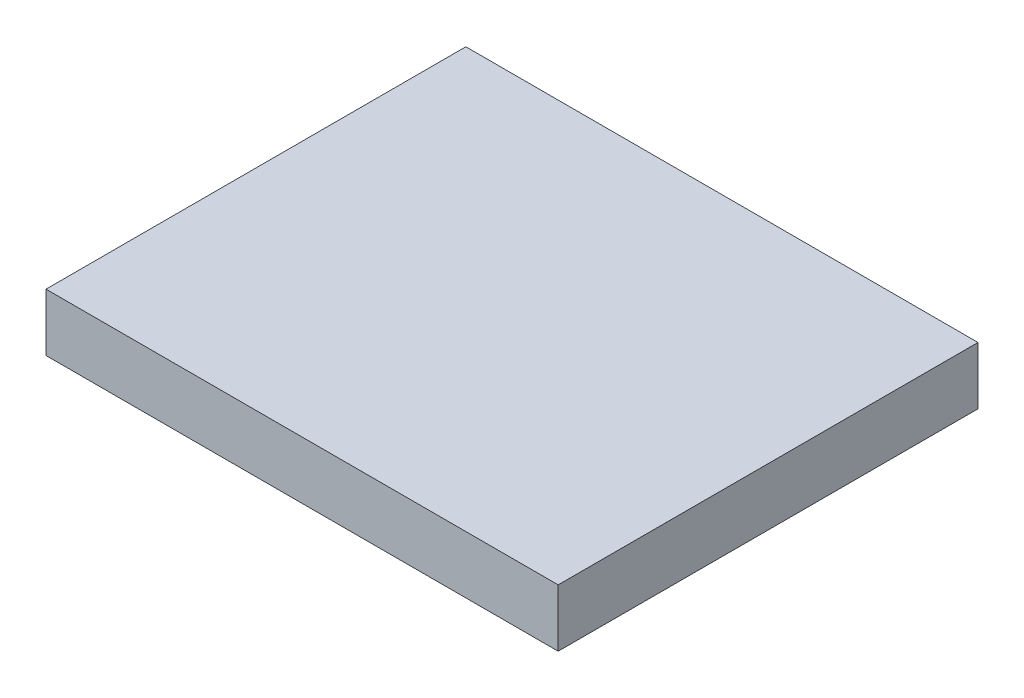
ISO-10303-21;
HEADER;
FILE_DESCRIPTION(('STEP AP214'),'2;1');
FILE_NAME('part.step','',(''),(''),'','','');
FILE_SCHEMA(('AUTOMOTIVE_DESIGN { 1 0 10303 214 1 1 1 1 }'));
ENDSEC;
DATA;
#1=APPLICATION_CONTEXT('core data for automotive mechanical design processes');
#2=APPLICATION_PROTOCOL_DEFINITION('international standard','automotive_design',2000,#1);
#3=PRODUCT_CONTEXT('',#1,'mechanical');
#4=PRODUCT('Part','Part','',(#3));
#5=PRODUCT_RELATED_PRODUCT_CATEGORY('part','',(#4));
#6=PRODUCT_DEFINITION_FORMATION('','',#4);
#7=PRODUCT_DEFINITION_CONTEXT('part definition',#1,'design');
#8=PRODUCT_DEFINITION('design','',#6,#7);
#9=PRODUCT_DEFINITION_SHAPE('','',#8);
#10=(LENGTH_UNIT() NAMED_UNIT(*) SI_UNIT(.MILLI.,.METRE.));
#11=(NAMED_UNIT(*) PLANE_ANGLE_UNIT() SI_UNIT($,.RADIAN.));
#12=(NAMED_UNIT(*) SI_UNIT($,.STERADIAN.) SOLID_ANGLE_UNIT());
#13=UNCERTAINTY_MEASURE_WITH_UNIT(LENGTH_MEASURE(1.E-05),#10,'distance_accuracy_value','');
#14=(GEOMETRIC_REPRESENTATION_CONTEXT(3) GLOBAL_UNCERTAINTY_ASSIGNED_CONTEXT((#13)) GLOBAL_UNIT_ASSIGNED_CONTEXT((#10,
#11,#12)) REPRESENTATION_CONTEXT('',''));
#15=CARTESIAN_POINT('',(0.,0.,0.));
#16=DIRECTION('',(0.,0.,1.));
#17=DIRECTION('',(1.,0.,0.));
#18=AXIS2_PLACEMENT_3D('',#15,#16,#17);
#19=CARTESIAN_POINT('',(13.9,0.,-11.6));
#20=DIRECTION('',(-1.,0.,0.));
#21=DIRECTION('',(0.,0.,1.));
#22=AXIS2_PLACEMENT_3D('',#19,#20,#21);
#23=PLANE('',#22);
#24=DIRECTION('',(0.,-1.,0.));
#25=VECTOR('',#24,1.);
#26=CARTESIAN_POINT('',(13.9,1.65,-11.6));
#27=LINE('',#26,#25);
#28=CARTESIAN_POINT('',(13.9,3.3,-11.6));
#29=VERTEX_POINT('',#28);
#30=CARTESIAN_POINT('',(13.9,0.,-11.6));
#31=VERTEX_POINT('',#30);
#32=EDGE_CURVE('E65',#29,#31,#27,.T.);
#33=ORIENTED_EDGE('',*,*,#32,.F.);
#34=DIRECTION('',(0.,0.,1.));
#35=VECTOR('',#34,1.);
#36=CARTESIAN_POINT('',(13.9,3.3,0.450000000000001));
#37=LINE('',#36,#35);
#38=CARTESIAN_POINT('',(13.9,3.3,12.5));
#39=VERTEX_POINT('',#38);
#40=EDGE_CURVE('E98',#29,#39,#37,.T.);
#41=ORIENTED_EDGE('',*,*,#40,.T.);
#42=DIRECTION('',(0.,1.,0.));
#43=VECTOR('',#42,1.);
#44=CARTESIAN_POINT('',(13.9,1.65,12.5));
#45=LINE('',#44,#43);
#46=CARTESIAN_POINT('',(13.9,0.,12.5));
#47=VERTEX_POINT('',#46);
#48=EDGE_CURVE('E20',#47,#39,#45,.T.);
#49=ORIENTED_EDGE('',*,*,#48,.F.);
#50=DIRECTION('',(0.,0.,1.));
#51=VECTOR('',#50,1.);
#52=CARTESIAN_POINT('',(13.9,0.,0.450000000000001));
#53=LINE('',#52,#51);
#54=EDGE_CURVE('E95',#31,#47,#53,.T.);
#55=ORIENTED_EDGE('',*,*,#54,.F.);
#56=EDGE_LOOP('',(#33,#41,#49,#55));
#57=FACE_BOUND('',#56,.T.);
#58=ADVANCED_FACE('F16',(#57),#23,.F.);
#59=CARTESIAN_POINT('',(-15.5,0.,12.5));
#60=DIRECTION('',(0.,0.,1.));
#61=DIRECTION('',(1.,0.,0.));
#62=AXIS2_PLACEMENT_3D('',#59,#60,#61);
#63=PLANE('',#62);
#64=ORIENTED_EDGE('',*,*,#48,.T.);
#65=DIRECTION('',(-1.,0.,0.));
#66=VECTOR('',#65,1.);
#67=CARTESIAN_POINT('',(-0.799999999999999,3.3,12.5));
#68=LINE('',#67,#66);
#69=CARTESIAN_POINT('',(-15.5,3.3,12.5));
#70=VERTEX_POINT('',#69);
#71=EDGE_CURVE('E70',#39,#70,#68,.T.);
#72=ORIENTED_EDGE('',*,*,#71,.T.);
#73=DIRECTION('',(0.,-1.,0.));
#74=VECTOR('',#73,1.);
#75=CARTESIAN_POINT('',(-15.5,1.65,12.5));
#76=LINE('',#75,#74);
#77=CARTESIAN_POINT('',(-15.5,0.,12.5));
#78=VERTEX_POINT('',#77);
#79=EDGE_CURVE('E60',#70,#78,#76,.T.);
#80=ORIENTED_EDGE('',*,*,#79,.T.);
#81=DIRECTION('',(-1.,0.,0.));
#82=VECTOR('',#81,1.);
#83=CARTESIAN_POINT('',(-0.799999999999999,0.,12.5));
#84=LINE('',#83,#82);
#85=EDGE_CURVE('E97',#47,#78,#84,.T.);
#86=ORIENTED_EDGE('',*,*,#85,.F.);
#87=EDGE_LOOP('',(#64,#72,#80,#86));
#88=FACE_BOUND('',#87,.T.);
#89=ADVANCED_FACE('F76',(#88),#63,.T.);
#90=CARTESIAN_POINT('',(-15.5,0.,12.5));
#91=DIRECTION('',(1.,0.,0.));
#92=DIRECTION('',(0.,0.,-1.));
#93=AXIS2_PLACEMENT_3D('',#90,#91,#92);
#94=PLANE('',#93);
#95=ORIENTED_EDGE('',*,*,#79,.F.);
#96=DIRECTION('',(0.,0.,-1.));
#97=VECTOR('',#96,1.);
#98=CARTESIAN_POINT('',(-15.5,3.3,0.450000000000001));
#99=LINE('',#98,#97);
#100=CARTESIAN_POINT('',(-15.5,3.3,-11.6));
#101=VERTEX_POINT('',#100);
#102=EDGE_CURVE('E63',#70,#101,#99,.T.);
#103=ORIENTED_EDGE('',*,*,#102,.T.);
#104=DIRECTION('',(0.,1.,0.));
#105=VECTOR('',#104,1.);
#106=CARTESIAN_POINT('',(-15.5,1.65,-11.6));
#107=LINE('',#106,#105);
#108=CARTESIAN_POINT('',(-15.5,0.,-11.6));
#109=VERTEX_POINT('',#108);
#110=EDGE_CURVE('E78',#109,#101,#107,.T.);
#111=ORIENTED_EDGE('',*,*,#110,.F.);
#112=DIRECTION('',(0.,0.,-1.));
#113=VECTOR('',#112,1.);
#114=CARTESIAN_POINT('',(-15.5,0.,0.450000000000001));
#115=LINE('',#114,#113);
#116=EDGE_CURVE('E27',#78,#109,#115,.T.);
#117=ORIENTED_EDGE('',*,*,#116,.F.);
#118=EDGE_LOOP('',(#95,#103,#111,#117));
#119=FACE_BOUND('',#118,.T.);
#120=ADVANCED_FACE('F62',(#119),#94,.F.);
#121=CARTESIAN_POINT('',(13.9,0.,-11.6));
#122=DIRECTION('',(0.,0.,-1.));
#123=DIRECTION('',(-1.,0.,0.));
#124=AXIS2_PLACEMENT_3D('',#121,#122,#123);
#125=PLANE('',#124);
#126=ORIENTED_EDGE('',*,*,#110,.T.);
#127=DIRECTION('',(1.,0.,0.));
#128=VECTOR('',#127,1.);
#129=CARTESIAN_POINT('',(-0.799999999999999,3.3,-11.6));
#130=LINE('',#129,#128);
#131=EDGE_CURVE('E73',#101,#29,#130,.T.);
#132=ORIENTED_EDGE('',*,*,#131,.T.);
#133=ORIENTED_EDGE('',*,*,#32,.T.);
#134=DIRECTION('',(1.,0.,0.));
#135=VECTOR('',#134,1.);
#136=CARTESIAN_POINT('',(-0.799999999999999,0.,-11.6));
#137=LINE('',#136,#135);
#138=EDGE_CURVE('E11',#109,#31,#137,.T.);
#139=ORIENTED_EDGE('',*,*,#138,.F.);
#140=EDGE_LOOP('',(#126,#132,#133,#139));
#141=FACE_BOUND('',#140,.T.);
#142=ADVANCED_FACE('F92',(#141),#125,.T.);
#143=CARTESIAN_POINT('',(-15.5,3.3,12.5));
#144=DIRECTION('',(0.,-1.,0.));
#145=DIRECTION('',(0.,0.,-1.));
#146=AXIS2_PLACEMENT_3D('',#143,#144,#145);
#147=PLANE('',#146);
#148=ORIENTED_EDGE('',*,*,#131,.F.);
#149=ORIENTED_EDGE('',*,*,#102,.F.);
#150=ORIENTED_EDGE('',*,*,#71,.F.);
#151=ORIENTED_EDGE('',*,*,#40,.F.);
#152=EDGE_LOOP('',(#148,#149,#150,#151));
#153=FACE_BOUND('',#152,.T.);
#154=ADVANCED_FACE('F68',(#153),#147,.F.);
#155=CARTESIAN_POINT('',(-15.5,0.,12.5));
#156=DIRECTION('',(0.,-1.,0.));
#157=DIRECTION('',(0.,0.,-1.));
#158=AXIS2_PLACEMENT_3D('',#155,#156,#157);
#159=PLANE('',#158);
#160=ORIENTED_EDGE('',*,*,#116,.T.);
#161=ORIENTED_EDGE('',*,*,#138,.T.);
#162=ORIENTED_EDGE('',*,*,#54,.T.);
#163=ORIENTED_EDGE('',*,*,#85,.T.);
#164=EDGE_LOOP('',(#160,#161,#162,#163));
#165=FACE_BOUND('',#164,.T.);
#166=ADVANCED_FACE('F18',(#165),#159,.T.);
#167=CLOSED_SHELL('',(#58,#89,#120,#142,#154,#166));
#168=MANIFOLD_SOLID_BREP('B1',#167);
#169=ADVANCED_BREP_SHAPE_REPRESENTATION('',(#18,#168),#14);
#170=SHAPE_DEFINITION_REPRESENTATION(#9,#169);
ENDSEC;
END-ISO-10303-21;
